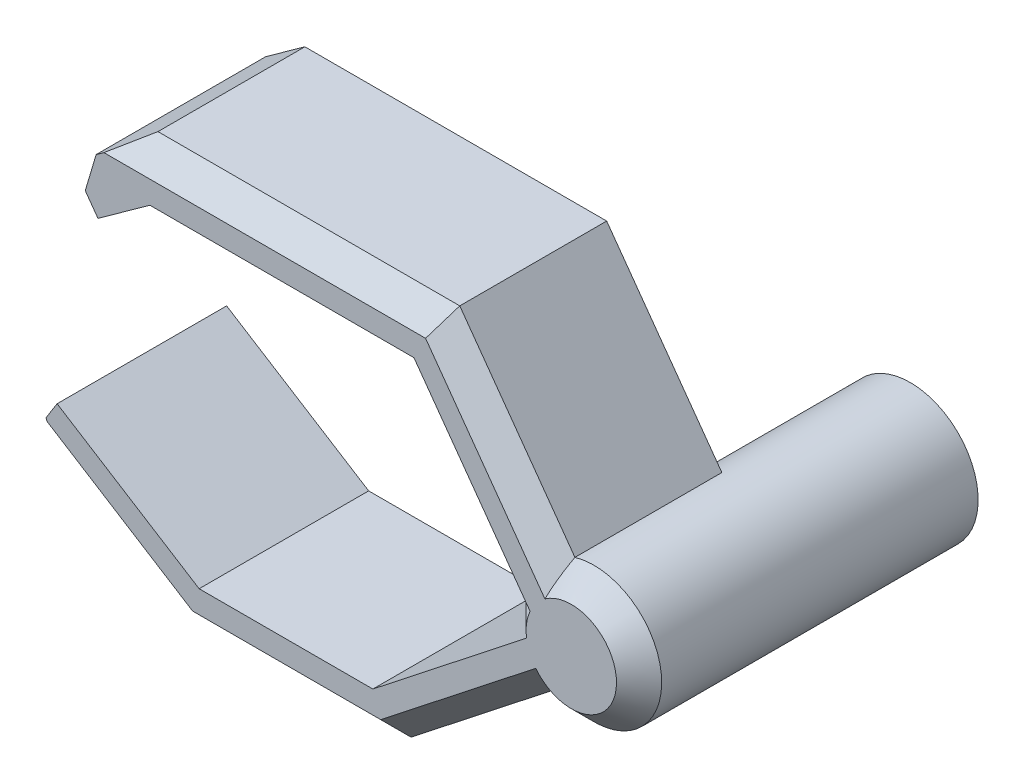
ISO-10303-21;
HEADER;
FILE_DESCRIPTION(('STEP AP214'),'2;1');
FILE_NAME('part.step','',(''),(''),'','','');
FILE_SCHEMA(('AUTOMOTIVE_DESIGN { 1 0 10303 214 1 1 1 1 }'));
ENDSEC;
DATA;
#1=APPLICATION_CONTEXT('core data for automotive mechanical design processes');
#2=APPLICATION_PROTOCOL_DEFINITION('international standard','automotive_design',2000,#1);
#3=PRODUCT_CONTEXT('',#1,'mechanical');
#4=PRODUCT('Part','Part','',(#3));
#5=PRODUCT_RELATED_PRODUCT_CATEGORY('part','',(#4));
#6=PRODUCT_DEFINITION_FORMATION('','',#4);
#7=PRODUCT_DEFINITION_CONTEXT('part definition',#1,'design');
#8=PRODUCT_DEFINITION('design','',#6,#7);
#9=PRODUCT_DEFINITION_SHAPE('','',#8);
#10=(LENGTH_UNIT() NAMED_UNIT(*) SI_UNIT(.MILLI.,.METRE.));
#11=(NAMED_UNIT(*) PLANE_ANGLE_UNIT() SI_UNIT($,.RADIAN.));
#12=(NAMED_UNIT(*) SI_UNIT($,.STERADIAN.) SOLID_ANGLE_UNIT());
#13=UNCERTAINTY_MEASURE_WITH_UNIT(LENGTH_MEASURE(1.E-05),#10,'distance_accuracy_value','');
#14=(GEOMETRIC_REPRESENTATION_CONTEXT(3) GLOBAL_UNCERTAINTY_ASSIGNED_CONTEXT((#13)) GLOBAL_UNIT_ASSIGNED_CONTEXT((#10,
#11,#12)) REPRESENTATION_CONTEXT('',''));
#15=CARTESIAN_POINT('',(0.,0.,0.));
#16=DIRECTION('',(0.,0.,1.));
#17=DIRECTION('',(1.,0.,0.));
#18=AXIS2_PLACEMENT_3D('',#15,#16,#17);
#19=CARTESIAN_POINT('',(0.,0.,0.));
#20=DIRECTION('',(0.,0.,1.));
#21=DIRECTION('',(1.,0.,0.));
#22=AXIS2_PLACEMENT_3D('',#19,#20,#21);
#23=PLANE('',#22);
#24=CARTESIAN_POINT('',(0.,0.,0.));
#25=DIRECTION('',(0.,0.,-1.));
#26=DIRECTION('',(-1.,0.,0.));
#27=AXIS2_PLACEMENT_3D('',#24,#25,#26);
#28=CIRCLE('',#27,6.);
#29=CARTESIAN_POINT('',(-4.92570755056817,3.4259896564753,0.));
#30=VERTEX_POINT('',#29);
#31=CARTESIAN_POINT('',(-1.67773652300311,5.76065969827948,0.));
#32=VERTEX_POINT('',#31);
#33=EDGE_CURVE('E54',#30,#32,#28,.T.);
#34=ORIENTED_EDGE('',*,*,#33,.F.);
#35=DIRECTION('',(0.583667510451045,-0.811992756891266,0.));
#36=VECTOR('',#35,1.);
#37=CARTESIAN_POINT('',(-2.74177615629843,0.387724819146812,0.));
#38=LINE('',#37,#36);
#39=CARTESIAN_POINT('',(-13.9203360042812,15.9392322553293,0.));
#40=VERTEX_POINT('',#39);
#41=EDGE_CURVE('E202',#40,#30,#38,.T.);
#42=ORIENTED_EDGE('',*,*,#41,.F.);
#43=DIRECTION('',(1.,0.,0.));
#44=VECTOR('',#43,1.);
#45=CARTESIAN_POINT('',(-13.9203360042812,15.9392322553293,0.));
#46=LINE('',#45,#44);
#47=CARTESIAN_POINT('',(-37.2880164769259,15.9392322553293,0.));
#48=VERTEX_POINT('',#47);
#49=EDGE_CURVE('E230',#48,#40,#46,.T.);
#50=ORIENTED_EDGE('',*,*,#49,.F.);
#51=DIRECTION('',(0.811992756891266,0.583667510451045,0.));
#52=VECTOR('',#51,1.);
#53=CARTESIAN_POINT('',(-37.2880164769259,15.9392322553293,0.));
#54=LINE('',#53,#52);
#55=CARTESIAN_POINT('',(-41.8852170549498,12.6347241871883,0.));
#56=VERTEX_POINT('',#55);
#57=EDGE_CURVE('E236',#56,#48,#54,.T.);
#58=ORIENTED_EDGE('',*,*,#57,.F.);
#59=DIRECTION('',(0.583667510451046,-0.811992756891266,0.));
#60=VECTOR('',#59,1.);
#61=CARTESIAN_POINT('',(-43.0096025455954,14.1989587179957,0.));
#62=LINE('',#61,#60);
#63=CARTESIAN_POINT('',(-43.0096025455954,14.1989587179957,0.));
#64=VERTEX_POINT('',#63);
#65=EDGE_CURVE('E510',#64,#56,#62,.T.);
#66=ORIENTED_EDGE('',*,*,#65,.F.);
#67=DIRECTION('',(-0.285038277399194,-0.958516134667174,0.));
#68=VECTOR('',#67,1.);
#69=CARTESIAN_POINT('',(-42.0437387137246,17.4469297455608,0.));
#70=LINE('',#69,#68);
#71=CARTESIAN_POINT('',(-42.0437387137246,17.4469297455608,0.));
#72=VERTEX_POINT('',#71);
#73=EDGE_CURVE('E506',#72,#64,#70,.T.);
#74=ORIENTED_EDGE('',*,*,#73,.F.);
#75=DIRECTION('',(-0.811992756891266,-0.583667510451045,0.));
#76=VECTOR('',#75,1.);
#77=CARTESIAN_POINT('',(-38.5764708777093,19.9392322553293,0.));
#78=LINE('',#77,#76);
#79=CARTESIAN_POINT('',(-38.5764708777093,19.9392322553293,0.));
#80=VERTEX_POINT('',#79);
#81=EDGE_CURVE('E502',#80,#72,#78,.T.);
#82=ORIENTED_EDGE('',*,*,#81,.F.);
#83=DIRECTION('',(-1.,0.,0.));
#84=VECTOR('',#83,1.);
#85=CARTESIAN_POINT('',(-11.8694187466304,19.9392322553293,0.));
#86=LINE('',#85,#84);
#87=CARTESIAN_POINT('',(-11.8694187466304,19.9392322553293,0.));
#88=VERTEX_POINT('',#87);
#89=EDGE_CURVE('E495',#88,#80,#86,.T.);
#90=ORIENTED_EDGE('',*,*,#89,.F.);
#91=DIRECTION('',(-0.583667510451046,0.811992756891266,0.));
#92=VECTOR('',#91,1.);
#93=CARTESIAN_POINT('',(2.74177615629843,-0.387724819146812,0.));
#94=LINE('',#93,#92);
#95=EDGE_CURVE('E205',#32,#88,#94,.T.);
#96=ORIENTED_EDGE('',*,*,#95,.F.);
#97=EDGE_LOOP('',(#34,#42,#50,#58,#66,#74,#82,#90,#96));
#98=FACE_BOUND('',#97,.T.);
#99=ADVANCED_FACE('F41',(#98),#23,.F.);
#100=CARTESIAN_POINT('',(-3.20927958866223,-5.06956847490948,0.));
#101=VERTEX_POINT('',#100);
#102=CARTESIAN_POINT('',(-5.68252967677999,-1.92583916060369,0.));
#103=VERTEX_POINT('',#102);
#104=EDGE_CURVE('E11',#101,#103,#28,.T.);
#105=ORIENTED_EDGE('',*,*,#104,.F.);
#106=DIRECTION('',(0.785932328576446,0.618312522029439,0.));
#107=VECTOR('',#106,1.);
#108=CARTESIAN_POINT('',(2.74177615629843,-0.387724819146812,0.));
#109=LINE('',#108,#107);
#110=CARTESIAN_POINT('',(-16.1754141997918,-15.2703492557461,0.));
#111=VERTEX_POINT('',#110);
#112=EDGE_CURVE('E484',#111,#101,#109,.T.);
#113=ORIENTED_EDGE('',*,*,#112,.F.);
#114=DIRECTION('',(1.,0.,0.));
#115=VECTOR('',#114,1.);
#116=CARTESIAN_POINT('',(-16.1754141997918,-15.2703492557461,0.));
#117=LINE('',#116,#115);
#118=CARTESIAN_POINT('',(-34.0839992741834,-15.2703492557461,0.));
#119=VERTEX_POINT('',#118);
#120=EDGE_CURVE('E301',#119,#111,#117,.T.);
#121=ORIENTED_EDGE('',*,*,#120,.F.);
#122=DIRECTION('',(0.846846656858256,-0.531837136507028,0.));
#123=VECTOR('',#122,1.);
#124=CARTESIAN_POINT('',(-34.0839992741834,-15.2703492557461,0.));
#125=LINE('',#124,#123);
#126=CARTESIAN_POINT('',(-45.1369510916235,-8.32886794158954,0.));
#127=VERTEX_POINT('',#126);
#128=EDGE_CURVE('E255',#127,#119,#125,.T.);
#129=ORIENTED_EDGE('',*,*,#128,.F.);
#130=DIRECTION('',(0.369338835561957,-0.929294799590387,0.));
#131=VECTOR('',#130,1.);
#132=CARTESIAN_POINT('',(-45.1369510916235,-8.32886794158954,0.));
#133=LINE('',#132,#131);
#134=CARTESIAN_POINT('',(-46.4832337062747,-4.94148131415651,0.));
#135=VERTEX_POINT('',#134);
#136=EDGE_CURVE('E251',#135,#127,#133,.T.);
#137=ORIENTED_EDGE('',*,*,#136,.F.);
#138=DIRECTION('',(-0.53183713650703,-0.846846656858255,0.));
#139=VECTOR('',#138,1.);
#140=CARTESIAN_POINT('',(-46.4832337062747,-4.94148131415651,0.));
#141=LINE('',#140,#139);
#142=CARTESIAN_POINT('',(-45.5007145627954,-3.37701167704294,0.));
#143=VERTEX_POINT('',#142);
#144=EDGE_CURVE('E247',#143,#135,#141,.T.);
#145=ORIENTED_EDGE('',*,*,#144,.F.);
#146=DIRECTION('',(-0.846846656858256,0.531837136507028,0.));
#147=VECTOR('',#146,1.);
#148=CARTESIAN_POINT('',(-32.9321177478378,-11.2703492557461,0.));
#149=LINE('',#148,#147);
#150=CARTESIAN_POINT('',(-32.9321177478378,-11.2703492557461,0.));
#151=VERTEX_POINT('',#150);
#152=EDGE_CURVE('E243',#151,#143,#149,.T.);
#153=ORIENTED_EDGE('',*,*,#152,.F.);
#154=DIRECTION('',(-1.,0.,0.));
#155=VECTOR('',#154,1.);
#156=CARTESIAN_POINT('',(-17.5602651532931,-11.2703492557461,0.));
#157=LINE('',#156,#155);
#158=CARTESIAN_POINT('',(-17.5602651532931,-11.2703492557461,0.));
#159=VERTEX_POINT('',#158);
#160=EDGE_CURVE('E234',#159,#151,#157,.T.);
#161=ORIENTED_EDGE('',*,*,#160,.F.);
#162=DIRECTION('',(-0.785932328576446,-0.618312522029439,0.));
#163=VECTOR('',#162,1.);
#164=CARTESIAN_POINT('',(-2.74177615629843,0.387724819146812,0.));
#165=LINE('',#164,#163);
#166=EDGE_CURVE('E229',#103,#159,#165,.T.);
#167=ORIENTED_EDGE('',*,*,#166,.F.);
#168=EDGE_LOOP('',(#105,#113,#121,#129,#137,#145,#153,#161,#167));
#169=FACE_BOUND('',#168,.T.);
#170=ADVANCED_FACE('F472',(#169),#23,.F.);
#171=CARTESIAN_POINT('',(0.,0.,15.));
#172=DIRECTION('',(0.,0.,-1.));
#173=DIRECTION('',(-1.,0.,0.));
#174=AXIS2_PLACEMENT_3D('',#171,#172,#173);
#175=CYLINDRICAL_SURFACE('',#174,6.);
#176=DIRECTION('',(0.,0.,-1.));
#177=VECTOR('',#176,1.);
#178=CARTESIAN_POINT('',(-1.6777365230031,5.76065969827948,15.));
#179=LINE('',#178,#177);
#180=CARTESIAN_POINT('',(-1.6777365230031,5.76065969827948,13.));
#181=VERTEX_POINT('',#180);
#182=EDGE_CURVE('E223',#32,#181,#179,.F.);
#183=ORIENTED_EDGE('',*,*,#182,.T.);
#184=CARTESIAN_POINT('',(0.,0.,13.));
#185=DIRECTION('',(0.,0.,1.));
#186=DIRECTION('',(1.,0.,0.));
#187=AXIS2_PLACEMENT_3D('',#184,#185,#186);
#188=CIRCLE('',#187,6.);
#189=CARTESIAN_POINT('',(-3.20927958866223,-5.06956847490948,13.));
#190=VERTEX_POINT('',#189);
#191=EDGE_CURVE('E392',#181,#190,#188,.F.);
#192=ORIENTED_EDGE('',*,*,#191,.T.);
#193=DIRECTION('',(0.,0.,-1.));
#194=VECTOR('',#193,1.);
#195=CARTESIAN_POINT('',(-3.20927958866223,-5.06956847490948,15.));
#196=LINE('',#195,#194);
#197=EDGE_CURVE('E306',#190,#101,#196,.T.);
#198=ORIENTED_EDGE('',*,*,#197,.T.);
#199=ORIENTED_EDGE('',*,*,#104,.T.);
#200=DIRECTION('',(0.,0.,-1.));
#201=VECTOR('',#200,1.);
#202=CARTESIAN_POINT('',(-5.68252967677999,-1.92583916060369,15.));
#203=LINE('',#202,#201);
#204=CARTESIAN_POINT('',(-5.68252967677999,-1.92583916060369,13.));
#205=VERTEX_POINT('',#204);
#206=EDGE_CURVE('E222',#103,#205,#203,.F.);
#207=ORIENTED_EDGE('',*,*,#206,.T.);
#208=CARTESIAN_POINT('',(0.,0.,13.));
#209=DIRECTION('',(0.,0.,1.));
#210=DIRECTION('',(1.,0.,0.));
#211=AXIS2_PLACEMENT_3D('',#208,#209,#210);
#212=CIRCLE('',#211,6.);
#213=CARTESIAN_POINT('',(-4.92570755056817,3.4259896564753,13.));
#214=VERTEX_POINT('',#213);
#215=EDGE_CURVE('E217',#205,#214,#212,.F.);
#216=ORIENTED_EDGE('',*,*,#215,.T.);
#217=DIRECTION('',(0.,0.,-1.));
#218=VECTOR('',#217,1.);
#219=CARTESIAN_POINT('',(-4.92570755056817,3.4259896564753,15.));
#220=LINE('',#219,#218);
#221=EDGE_CURVE('E212',#214,#30,#220,.T.);
#222=ORIENTED_EDGE('',*,*,#221,.T.);
#223=ORIENTED_EDGE('',*,*,#33,.T.);
#224=EDGE_LOOP('',(#183,#192,#198,#199,#207,#216,#222,#223));
#225=FACE_BOUND('',#224,.T.);
#226=CARTESIAN_POINT('',(0.,0.,-15.));
#227=DIRECTION('',(0.,0.,-1.));
#228=DIRECTION('',(-1.,0.,0.));
#229=AXIS2_PLACEMENT_3D('',#226,#227,#228);
#230=CIRCLE('',#229,6.);
#231=CARTESIAN_POINT('',(-6.,0.,-15.));
#232=VERTEX_POINT('',#231);
#233=EDGE_CURVE('E210',#232,#232,#230,.T.);
#234=ORIENTED_EDGE('',*,*,#233,.F.);
#235=EDGE_LOOP('',(#234));
#236=FACE_BOUND('',#235,.T.);
#237=ADVANCED_FACE('F213',(#225,#236),#175,.T.);
#238=CARTESIAN_POINT('',(0.,0.,15.));
#239=DIRECTION('',(0.,0.,1.));
#240=DIRECTION('',(1.,0.,0.));
#241=AXIS2_PLACEMENT_3D('',#238,#239,#240);
#242=PLANE('',#241);
#243=CARTESIAN_POINT('',(0.,0.,15.));
#244=DIRECTION('',(0.,0.,1.));
#245=DIRECTION('',(1.,0.,0.));
#246=AXIS2_PLACEMENT_3D('',#243,#244,#245);
#247=CIRCLE('',#246,4.);
#248=CARTESIAN_POINT('',(-3.64586907943943,1.6454903997251,15.));
#249=VERTEX_POINT('',#248);
#250=CARTESIAN_POINT('',(-3.95917449286952,-0.570032749069185,15.));
#251=VERTEX_POINT('',#250);
#252=EDGE_CURVE('E374',#249,#251,#247,.T.);
#253=ORIENTED_EDGE('',*,*,#252,.T.);
#254=DIRECTION('',(-0.785932328576446,-0.618312522029439,0.));
#255=VECTOR('',#254,1.);
#256=CARTESIAN_POINT('',(-2.74177615629843,0.387724819146812,15.));
#257=LINE('',#256,#255);
#258=CARTESIAN_POINT('',(-17.5602651532931,-11.2703492557461,15.));
#259=VERTEX_POINT('',#258);
#260=EDGE_CURVE('E282',#251,#259,#257,.T.);
#261=ORIENTED_EDGE('',*,*,#260,.T.);
#262=DIRECTION('',(-1.,0.,0.));
#263=VECTOR('',#262,1.);
#264=CARTESIAN_POINT('',(-17.5602651532931,-11.2703492557461,15.));
#265=LINE('',#264,#263);
#266=CARTESIAN_POINT('',(-32.9321177478378,-11.2703492557461,15.));
#267=VERTEX_POINT('',#266);
#268=EDGE_CURVE('E285',#259,#267,#265,.T.);
#269=ORIENTED_EDGE('',*,*,#268,.T.);
#270=DIRECTION('',(-0.846846656858256,0.531837136507028,0.));
#271=VECTOR('',#270,1.);
#272=CARTESIAN_POINT('',(-32.9321177478378,-11.2703492557461,15.));
#273=LINE('',#272,#271);
#274=CARTESIAN_POINT('',(-45.5007145627954,-3.37701167704294,15.));
#275=VERTEX_POINT('',#274);
#276=EDGE_CURVE('E289',#267,#275,#273,.T.);
#277=ORIENTED_EDGE('',*,*,#276,.T.);
#278=DIRECTION('',(-0.53183713650703,-0.846846656858255,0.));
#279=VECTOR('',#278,1.);
#280=CARTESIAN_POINT('',(-46.4832337062747,-4.94148131415651,15.));
#281=LINE('',#280,#279);
#282=CARTESIAN_POINT('',(-46.4832337062747,-4.94148131415651,15.));
#283=VERTEX_POINT('',#282);
#284=EDGE_CURVE('E293',#275,#283,#281,.T.);
#285=ORIENTED_EDGE('',*,*,#284,.T.);
#286=DIRECTION('',(0.369338835561957,-0.929294799590387,0.));
#287=VECTOR('',#286,1.);
#288=CARTESIAN_POINT('',(-45.1369510916235,-8.32886794158954,15.));
#289=LINE('',#288,#287);
#290=CARTESIAN_POINT('',(-46.3877978799942,-5.18160774689981,15.));
#291=VERTEX_POINT('',#290);
#292=EDGE_CURVE('E297',#283,#291,#289,.T.);
#293=ORIENTED_EDGE('',*,*,#292,.T.);
#294=DIRECTION('',(0.846846656858256,-0.531837136507028,0.));
#295=VECTOR('',#294,1.);
#296=CARTESIAN_POINT('',(-15.454538766258,-24.6083313652148,15.));
#297=LINE('',#296,#295);
#298=CARTESIAN_POINT('',(-33.5080585110106,-13.2703492557461,15.));
#299=VERTEX_POINT('',#298);
#300=EDGE_CURVE('E370',#291,#299,#297,.T.);
#301=ORIENTED_EDGE('',*,*,#300,.T.);
#302=DIRECTION('',(1.,0.,0.));
#303=VECTOR('',#302,1.);
#304=CARTESIAN_POINT('',(0.,-13.2703492557461,15.));
#305=LINE('',#304,#303);
#306=CARTESIAN_POINT('',(-16.8678396765425,-13.2703492557461,15.));
#307=VERTEX_POINT('',#306);
#308=EDGE_CURVE('E367',#299,#307,#305,.T.);
#309=ORIENTED_EDGE('',*,*,#308,.T.);
#310=DIRECTION('',(0.785932328576446,0.618312522029439,0.));
#311=VECTOR('',#310,1.);
#312=CARTESIAN_POINT('',(0.,0.,15.));
#313=LINE('',#312,#311);
#314=CARTESIAN_POINT('',(-3.14372931430579,-2.47325008811776,15.));
#315=VERTEX_POINT('',#314);
#316=EDGE_CURVE('E364',#307,#315,#313,.T.);
#317=ORIENTED_EDGE('',*,*,#316,.T.);
#318=CARTESIAN_POINT('',(0.,0.,15.));
#319=DIRECTION('',(0.,0.,1.));
#320=DIRECTION('',(1.,0.,0.));
#321=AXIS2_PLACEMENT_3D('',#318,#319,#320);
#322=CIRCLE('',#321,4.00000000000001);
#323=CARTESIAN_POINT('',(-2.33467004180419,3.24797102756507,15.));
#324=VERTEX_POINT('',#323);
#325=EDGE_CURVE('E361',#315,#324,#322,.T.);
#326=ORIENTED_EDGE('',*,*,#325,.T.);
#327=DIRECTION('',(-0.583667510451046,0.811992756891266,0.));
#328=VECTOR('',#327,1.);
#329=CARTESIAN_POINT('',(0.,0.,15.));
#330=LINE('',#329,#328);
#331=CARTESIAN_POINT('',(-12.8948773754558,17.9392322553294,15.));
#332=VERTEX_POINT('',#331);
#333=EDGE_CURVE('E358',#324,#332,#330,.T.);
#334=ORIENTED_EDGE('',*,*,#333,.T.);
#335=DIRECTION('',(-1.,0.,0.));
#336=VECTOR('',#335,1.);
#337=CARTESIAN_POINT('',(0.,17.9392322553294,15.));
#338=LINE('',#337,#336);
#339=CARTESIAN_POINT('',(-41.3588520873942,17.9392322553294,15.));
#340=VERTEX_POINT('',#339);
#341=EDGE_CURVE('E355',#332,#340,#338,.T.);
#342=ORIENTED_EDGE('',*,*,#341,.T.);
#343=DIRECTION('',(-0.811992756891266,-0.583667510451045,0.));
#344=VECTOR('',#343,1.);
#345=CARTESIAN_POINT('',(-38.5764708777093,19.9392322553293,15.));
#346=LINE('',#345,#344);
#347=CARTESIAN_POINT('',(-42.0437387137246,17.4469297455608,15.));
#348=VERTEX_POINT('',#347);
#349=EDGE_CURVE('E260',#340,#348,#346,.T.);
#350=ORIENTED_EDGE('',*,*,#349,.T.);
#351=DIRECTION('',(-0.285038277399194,-0.958516134667174,0.));
#352=VECTOR('',#351,1.);
#353=CARTESIAN_POINT('',(-42.0437387137246,17.4469297455608,15.));
#354=LINE('',#353,#352);
#355=CARTESIAN_POINT('',(-43.0096025455954,14.1989587179957,15.));
#356=VERTEX_POINT('',#355);
#357=EDGE_CURVE('E263',#348,#356,#354,.T.);
#358=ORIENTED_EDGE('',*,*,#357,.T.);
#359=DIRECTION('',(0.583667510451046,-0.811992756891266,0.));
#360=VECTOR('',#359,1.);
#361=CARTESIAN_POINT('',(-43.0096025455954,14.1989587179957,15.));
#362=LINE('',#361,#360);
#363=CARTESIAN_POINT('',(-41.8852170549498,12.6347241871883,15.));
#364=VERTEX_POINT('',#363);
#365=EDGE_CURVE('E267',#356,#364,#362,.T.);
#366=ORIENTED_EDGE('',*,*,#365,.T.);
#367=DIRECTION('',(0.811992756891266,0.583667510451045,0.));
#368=VECTOR('',#367,1.);
#369=CARTESIAN_POINT('',(-37.2880164769259,15.9392322553293,15.));
#370=LINE('',#369,#368);
#371=CARTESIAN_POINT('',(-37.2880164769259,15.9392322553293,15.));
#372=VERTEX_POINT('',#371);
#373=EDGE_CURVE('E271',#364,#372,#370,.T.);
#374=ORIENTED_EDGE('',*,*,#373,.T.);
#375=DIRECTION('',(1.,0.,0.));
#376=VECTOR('',#375,1.);
#377=CARTESIAN_POINT('',(-13.9203360042812,15.9392322553293,15.));
#378=LINE('',#377,#376);
#379=CARTESIAN_POINT('',(-13.9203360042812,15.9392322553293,15.));
#380=VERTEX_POINT('',#379);
#381=EDGE_CURVE('E275',#372,#380,#378,.T.);
#382=ORIENTED_EDGE('',*,*,#381,.T.);
#383=DIRECTION('',(0.583667510451045,-0.811992756891266,0.));
#384=VECTOR('',#383,1.);
#385=CARTESIAN_POINT('',(-2.74177615629843,0.387724819146812,15.));
#386=LINE('',#385,#384);
#387=EDGE_CURVE('E279',#380,#249,#386,.T.);
#388=ORIENTED_EDGE('',*,*,#387,.T.);
#389=EDGE_LOOP('',(#253,#261,#269,#277,#285,#293,#301,#309,#317,#326,#334,#342,#350,#358,#366,
#374,#382,#388));
#390=FACE_BOUND('',#389,.T.);
#391=ADVANCED_FACE('F466',(#390),#242,.T.);
#392=CARTESIAN_POINT('',(-16.1754141997918,-15.2703492557461,0.));
#393=DIRECTION('',(0.,-1.,0.));
#394=DIRECTION('',(1.,0.,0.));
#395=AXIS2_PLACEMENT_3D('',#392,#393,#394);
#396=PLANE('',#395);
#397=DIRECTION('',(0.,0.,1.));
#398=VECTOR('',#397,1.);
#399=CARTESIAN_POINT('',(-16.1754141997918,-15.2703492557461,0.));
#400=LINE('',#399,#398);
#401=CARTESIAN_POINT('',(-16.1754141997918,-15.2703492557461,13.));
#402=VERTEX_POINT('',#401);
#403=EDGE_CURVE('E259',#111,#402,#400,.T.);
#404=ORIENTED_EDGE('',*,*,#403,.T.);
#405=DIRECTION('',(-1.,0.,0.));
#406=VECTOR('',#405,1.);
#407=CARTESIAN_POINT('',(-16.1754141997918,-15.2703492557461,13.));
#408=LINE('',#407,#406);
#409=CARTESIAN_POINT('',(-34.0839992741834,-15.2703492557461,13.));
#410=VERTEX_POINT('',#409);
#411=EDGE_CURVE('E386',#402,#410,#408,.T.);
#412=ORIENTED_EDGE('',*,*,#411,.T.);
#413=DIRECTION('',(0.,0.,1.));
#414=VECTOR('',#413,1.);
#415=CARTESIAN_POINT('',(-34.0839992741834,-15.2703492557461,0.));
#416=LINE('',#415,#414);
#417=EDGE_CURVE('E302',#119,#410,#416,.T.);
#418=ORIENTED_EDGE('',*,*,#417,.F.);
#419=ORIENTED_EDGE('',*,*,#120,.T.);
#420=EDGE_LOOP('',(#404,#412,#418,#419));
#421=FACE_BOUND('',#420,.T.);
#422=ADVANCED_FACE('F462',(#421),#396,.T.);
#423=CARTESIAN_POINT('',(-34.0839992741834,-15.2703492557461,0.));
#424=DIRECTION('',(-0.531837136507028,-0.846846656858256,0.));
#425=DIRECTION('',(0.846846656858256,-0.531837136507028,0.));
#426=AXIS2_PLACEMENT_3D('',#423,#424,#425);
#427=PLANE('',#426);
#428=ORIENTED_EDGE('',*,*,#417,.T.);
#429=DIRECTION('',(-0.846846656858256,0.531837136507028,0.));
#430=VECTOR('',#429,1.);
#431=CARTESIAN_POINT('',(-34.0839992741834,-15.2703492557461,13.));
#432=LINE('',#431,#430);
#433=CARTESIAN_POINT('',(-45.1369510916235,-8.32886794158954,13.));
#434=VERTEX_POINT('',#433);
#435=EDGE_CURVE('E380',#410,#434,#432,.T.);
#436=ORIENTED_EDGE('',*,*,#435,.T.);
#437=DIRECTION('',(0.,0.,1.));
#438=VECTOR('',#437,1.);
#439=CARTESIAN_POINT('',(-45.1369510916235,-8.32886794158954,0.));
#440=LINE('',#439,#438);
#441=EDGE_CURVE('E307',#127,#434,#440,.T.);
#442=ORIENTED_EDGE('',*,*,#441,.F.);
#443=ORIENTED_EDGE('',*,*,#128,.T.);
#444=EDGE_LOOP('',(#428,#436,#442,#443));
#445=FACE_BOUND('',#444,.T.);
#446=ADVANCED_FACE('F465',(#445),#427,.T.);
#447=CARTESIAN_POINT('',(-45.1369510916235,-8.32886794158954,0.));
#448=DIRECTION('',(-0.929294799590387,-0.369338835561957,0.));
#449=DIRECTION('',(0.369338835561957,-0.929294799590387,0.));
#450=AXIS2_PLACEMENT_3D('',#447,#448,#449);
#451=PLANE('',#450);
#452=ORIENTED_EDGE('',*,*,#441,.T.);
#453=DIRECTION('',(0.318024709109134,-0.800183137705233,-0.508495064408947));
#454=VECTOR('',#453,1.);
#455=CARTESIAN_POINT('',(-43.0346691573764,-13.6184272314924,9.63862600313263));
#456=LINE('',#455,#454);
#457=EDGE_CURVE('E383',#434,#291,#456,.F.);
#458=ORIENTED_EDGE('',*,*,#457,.T.);
#459=ORIENTED_EDGE('',*,*,#292,.F.);
#460=DIRECTION('',(0.,0.,1.));
#461=VECTOR('',#460,1.);
#462=CARTESIAN_POINT('',(-46.4832337062747,-4.94148131415651,0.));
#463=LINE('',#462,#461);
#464=EDGE_CURVE('E311',#135,#283,#463,.T.);
#465=ORIENTED_EDGE('',*,*,#464,.F.);
#466=ORIENTED_EDGE('',*,*,#136,.T.);
#467=EDGE_LOOP('',(#452,#458,#459,#465,#466));
#468=FACE_BOUND('',#467,.T.);
#469=ADVANCED_FACE('F557',(#468),#451,.T.);
#470=CARTESIAN_POINT('',(-46.4832337062747,-4.94148131415651,0.));
#471=DIRECTION('',(-0.846846656858255,0.53183713650703,0.));
#472=DIRECTION('',(-0.53183713650703,-0.846846656858255,0.));
#473=AXIS2_PLACEMENT_3D('',#470,#471,#472);
#474=PLANE('',#473);
#475=ORIENTED_EDGE('',*,*,#284,.F.);
#476=DIRECTION('',(0.,0.,1.));
#477=VECTOR('',#476,1.);
#478=CARTESIAN_POINT('',(-45.5007145627954,-3.37701167704294,0.));
#479=LINE('',#478,#477);
#480=EDGE_CURVE('E314',#143,#275,#479,.T.);
#481=ORIENTED_EDGE('',*,*,#480,.F.);
#482=ORIENTED_EDGE('',*,*,#144,.T.);
#483=ORIENTED_EDGE('',*,*,#464,.T.);
#484=EDGE_LOOP('',(#475,#481,#482,#483));
#485=FACE_BOUND('',#484,.T.);
#486=ADVANCED_FACE('F563',(#485),#474,.T.);
#487=CARTESIAN_POINT('',(-32.9321177478378,-11.2703492557461,0.));
#488=DIRECTION('',(0.531837136507028,0.846846656858256,0.));
#489=DIRECTION('',(-0.846846656858256,0.531837136507028,0.));
#490=AXIS2_PLACEMENT_3D('',#487,#488,#489);
#491=PLANE('',#490);
#492=ORIENTED_EDGE('',*,*,#276,.F.);
#493=DIRECTION('',(0.,0.,1.));
#494=VECTOR('',#493,1.);
#495=CARTESIAN_POINT('',(-32.9321177478378,-11.2703492557461,0.));
#496=LINE('',#495,#494);
#497=EDGE_CURVE('E317',#151,#267,#496,.T.);
#498=ORIENTED_EDGE('',*,*,#497,.F.);
#499=ORIENTED_EDGE('',*,*,#152,.T.);
#500=ORIENTED_EDGE('',*,*,#480,.T.);
#501=EDGE_LOOP('',(#492,#498,#499,#500));
#502=FACE_BOUND('',#501,.T.);
#503=ADVANCED_FACE('F566',(#502),#491,.T.);
#504=CARTESIAN_POINT('',(-17.5602651532931,-11.2703492557461,0.));
#505=DIRECTION('',(0.,1.,0.));
#506=DIRECTION('',(0.,0.,1.));
#507=AXIS2_PLACEMENT_3D('',#504,#505,#506);
#508=PLANE('',#507);
#509=ORIENTED_EDGE('',*,*,#268,.F.);
#510=DIRECTION('',(0.,0.,1.));
#511=VECTOR('',#510,1.);
#512=CARTESIAN_POINT('',(-17.5602651532931,-11.2703492557461,0.));
#513=LINE('',#512,#511);
#514=EDGE_CURVE('E320',#159,#259,#513,.T.);
#515=ORIENTED_EDGE('',*,*,#514,.F.);
#516=ORIENTED_EDGE('',*,*,#160,.T.);
#517=ORIENTED_EDGE('',*,*,#497,.T.);
#518=EDGE_LOOP('',(#509,#515,#516,#517));
#519=FACE_BOUND('',#518,.T.);
#520=ADVANCED_FACE('F428',(#519),#508,.T.);
#521=CARTESIAN_POINT('',(2.74177615629843,-0.387724819146812,0.));
#522=DIRECTION('',(0.618312522029439,-0.785932328576446,0.));
#523=DIRECTION('',(0.785932328576446,0.618312522029439,0.));
#524=AXIS2_PLACEMENT_3D('',#521,#522,#523);
#525=PLANE('',#524);
#526=ORIENTED_EDGE('',*,*,#197,.F.);
#527=DIRECTION('',(-0.785932328576446,-0.618312522029439,0.));
#528=VECTOR('',#527,1.);
#529=CARTESIAN_POINT('',(2.74177615629843,-0.387724819146812,13.));
#530=LINE('',#529,#528);
#531=EDGE_CURVE('E389',#190,#402,#530,.T.);
#532=ORIENTED_EDGE('',*,*,#531,.T.);
#533=ORIENTED_EDGE('',*,*,#403,.F.);
#534=ORIENTED_EDGE('',*,*,#112,.T.);
#535=EDGE_LOOP('',(#526,#532,#533,#534));
#536=FACE_BOUND('',#535,.T.);
#537=ADVANCED_FACE('F426',(#536),#525,.T.);
#538=CARTESIAN_POINT('',(-2.74177615629843,0.387724819146812,0.));
#539=DIRECTION('',(-0.618312522029439,0.785932328576446,0.));
#540=DIRECTION('',(-0.785932328576446,-0.618312522029439,0.));
#541=AXIS2_PLACEMENT_3D('',#538,#539,#540);
#542=PLANE('',#541);
#543=ORIENTED_EDGE('',*,*,#206,.F.);
#544=ORIENTED_EDGE('',*,*,#166,.T.);
#545=ORIENTED_EDGE('',*,*,#514,.T.);
#546=ORIENTED_EDGE('',*,*,#260,.F.);
#547=CARTESIAN_POINT('',(-3.95917449286952,-0.570032749069185,15.));
#548=CARTESIAN_POINT('',(-4.0326512346754,-0.627838730429933,14.9190245665213));
#549=CARTESIAN_POINT('',(-4.10581686855001,-0.685399955438751,14.8375950870917));
#550=CARTESIAN_POINT('',(-4.25161800243795,-0.800105335954522,14.6739749288848));
#551=CARTESIAN_POINT('',(-4.32425351368668,-0.857249500300636,14.5917842663242));
#552=CARTESIAN_POINT('',(-4.54149286261855,-1.02815710244164,14.3443024744829));
#553=CARTESIAN_POINT('',(-4.68544447353481,-1.14140741720736,14.1780849550509));
#554=CARTESIAN_POINT('',(-4.97210015790169,-1.36692657796767,13.8439439214904));
#555=CARTESIAN_POINT('',(-5.11480430204817,-1.47919547958046,13.6760205052192));
#556=CARTESIAN_POINT('',(-5.39928858443149,-1.70300634436163,13.3388733185191));
#557=CARTESIAN_POINT('',(-5.54106862667801,-1.81454823201202,13.1696494168597));
#558=CARTESIAN_POINT('',(-5.68252967677999,-1.92583916060369,13.));
#559=B_SPLINE_CURVE_WITH_KNOTS('',3,(#547,#548,#549,#550,#551,#552,#553,#554,#555,#556,#557,
#558),.UNSPECIFIED.,.F.,.F.,(4,2,2,2,2,4),(0.,0.371043399232291,0.742078911620059,
1.48407420808337,2.22602717831648,2.96805602782539),.UNSPECIFIED.);
#560=EDGE_CURVE('E402',#251,#205,#559,.T.);
#561=ORIENTED_EDGE('',*,*,#560,.T.);
#562=EDGE_LOOP('',(#543,#544,#545,#546,#561));
#563=FACE_BOUND('',#562,.T.);
#564=ADVANCED_FACE('F422',(#563),#542,.T.);
#565=CARTESIAN_POINT('',(-2.74177615629843,0.387724819146812,0.));
#566=DIRECTION('',(-0.811992756891266,-0.583667510451045,0.));
#567=DIRECTION('',(0.583667510451045,-0.811992756891266,0.));
#568=AXIS2_PLACEMENT_3D('',#565,#566,#567);
#569=PLANE('',#568);
#570=ORIENTED_EDGE('',*,*,#221,.F.);
#571=CARTESIAN_POINT('',(-4.92570755056817,3.4259896564753,13.));
#572=CARTESIAN_POINT('',(-4.82065242567165,3.27983795372872,13.1696494168597));
#573=CARTESIAN_POINT('',(-4.7153604033425,3.13335668149954,13.3388733185191));
#574=CARTESIAN_POINT('',(-4.50409000915744,2.83943929402793,13.6760205052192));
#575=CARTESIAN_POINT('',(-4.39811170858812,2.69200327795873,13.8439439214904));
#576=CARTESIAN_POINT('',(-4.18522873690262,2.39584248781892,14.1780849550509));
#577=CARTESIAN_POINT('',(-4.07832401328463,2.24711764070829,14.3443024744829));
#578=CARTESIAN_POINT('',(-3.91699262971279,2.02267493561693,14.5917842663242));
#579=CARTESIAN_POINT('',(-3.86305034170732,1.94763093134001,14.6739749288848));
#580=CARTESIAN_POINT('',(-3.75477208193468,1.79699523363562,14.8375950870917));
#581=CARTESIAN_POINT('',(-3.70043610182362,1.72140352860022,14.9190245665213));
#582=CARTESIAN_POINT('',(-3.64586907943943,1.6454903997251,15.));
#583=B_SPLINE_CURVE_WITH_KNOTS('',3,(#571,#572,#573,#574,#575,#576,#577,#578,#579,#580,#581,
#582),.UNSPECIFIED.,.F.,.F.,(4,2,2,2,2,4),(0.,0.742028849508901,1.48398181974201,
2.22597711620533,2.5970126285931,2.96805602782539),.UNSPECIFIED.);
#584=EDGE_CURVE('E52',#214,#249,#583,.T.);
#585=ORIENTED_EDGE('',*,*,#584,.T.);
#586=ORIENTED_EDGE('',*,*,#387,.F.);
#587=DIRECTION('',(0.,0.,1.));
#588=VECTOR('',#587,1.);
#589=CARTESIAN_POINT('',(-13.9203360042812,15.9392322553293,0.));
#590=LINE('',#589,#588);
#591=EDGE_CURVE('E227',#40,#380,#590,.T.);
#592=ORIENTED_EDGE('',*,*,#591,.F.);
#593=ORIENTED_EDGE('',*,*,#41,.T.);
#594=EDGE_LOOP('',(#570,#585,#586,#592,#593));
#595=FACE_BOUND('',#594,.T.);
#596=ADVANCED_FACE('F225',(#595),#569,.T.);
#597=CARTESIAN_POINT('',(2.74177615629843,-0.387724819146812,0.));
#598=DIRECTION('',(0.811992756891266,0.583667510451046,0.));
#599=DIRECTION('',(-0.583667510451046,0.811992756891266,0.));
#600=AXIS2_PLACEMENT_3D('',#597,#598,#599);
#601=PLANE('',#600);
#602=DIRECTION('',(0.,0.,1.));
#603=VECTOR('',#602,1.);
#604=CARTESIAN_POINT('',(-11.8694187466304,19.9392322553293,0.));
#605=LINE('',#604,#603);
#606=CARTESIAN_POINT('',(-11.8694187466304,19.9392322553293,13.));
#607=VERTEX_POINT('',#606);
#608=EDGE_CURVE('E342',#88,#607,#605,.T.);
#609=ORIENTED_EDGE('',*,*,#608,.T.);
#610=DIRECTION('',(0.583667510451046,-0.811992756891266,0.));
#611=VECTOR('',#610,1.);
#612=CARTESIAN_POINT('',(2.74177615629843,-0.387724819146812,13.));
#613=LINE('',#612,#611);
#614=EDGE_CURVE('E395',#607,#181,#613,.T.);
#615=ORIENTED_EDGE('',*,*,#614,.T.);
#616=ORIENTED_EDGE('',*,*,#182,.F.);
#617=ORIENTED_EDGE('',*,*,#95,.T.);
#618=EDGE_LOOP('',(#609,#615,#616,#617));
#619=FACE_BOUND('',#618,.T.);
#620=ADVANCED_FACE('F433',(#619),#601,.T.);
#621=CARTESIAN_POINT('',(-13.9203360042812,15.9392322553293,0.));
#622=DIRECTION('',(0.,-1.,0.));
#623=DIRECTION('',(0.,0.,-1.));
#624=AXIS2_PLACEMENT_3D('',#621,#622,#623);
#625=PLANE('',#624);
#626=ORIENTED_EDGE('',*,*,#381,.F.);
#627=DIRECTION('',(0.,0.,1.));
#628=VECTOR('',#627,1.);
#629=CARTESIAN_POINT('',(-37.2880164769259,15.9392322553293,0.));
#630=LINE('',#629,#628);
#631=EDGE_CURVE('E326',#48,#372,#630,.T.);
#632=ORIENTED_EDGE('',*,*,#631,.F.);
#633=ORIENTED_EDGE('',*,*,#49,.T.);
#634=ORIENTED_EDGE('',*,*,#591,.T.);
#635=EDGE_LOOP('',(#626,#632,#633,#634));
#636=FACE_BOUND('',#635,.T.);
#637=ADVANCED_FACE('F434',(#636),#625,.T.);
#638=CARTESIAN_POINT('',(-37.2880164769259,15.9392322553293,0.));
#639=DIRECTION('',(0.583667510451045,-0.811992756891266,0.));
#640=DIRECTION('',(0.811992756891266,0.583667510451045,0.));
#641=AXIS2_PLACEMENT_3D('',#638,#639,#640);
#642=PLANE('',#641);
#643=ORIENTED_EDGE('',*,*,#373,.F.);
#644=DIRECTION('',(0.,0.,1.));
#645=VECTOR('',#644,1.);
#646=CARTESIAN_POINT('',(-41.8852170549498,12.6347241871883,0.));
#647=LINE('',#646,#645);
#648=EDGE_CURVE('E329',#56,#364,#647,.T.);
#649=ORIENTED_EDGE('',*,*,#648,.F.);
#650=ORIENTED_EDGE('',*,*,#57,.T.);
#651=ORIENTED_EDGE('',*,*,#631,.T.);
#652=EDGE_LOOP('',(#643,#649,#650,#651));
#653=FACE_BOUND('',#652,.T.);
#654=ADVANCED_FACE('F437',(#653),#642,.T.);
#655=CARTESIAN_POINT('',(-43.0096025455954,14.1989587179957,0.));
#656=DIRECTION('',(-0.811992756891266,-0.583667510451046,0.));
#657=DIRECTION('',(0.583667510451046,-0.811992756891266,0.));
#658=AXIS2_PLACEMENT_3D('',#655,#656,#657);
#659=PLANE('',#658);
#660=ORIENTED_EDGE('',*,*,#365,.F.);
#661=DIRECTION('',(0.,0.,1.));
#662=VECTOR('',#661,1.);
#663=CARTESIAN_POINT('',(-43.0096025455954,14.1989587179957,0.));
#664=LINE('',#663,#662);
#665=EDGE_CURVE('E332',#64,#356,#664,.T.);
#666=ORIENTED_EDGE('',*,*,#665,.F.);
#667=ORIENTED_EDGE('',*,*,#65,.T.);
#668=ORIENTED_EDGE('',*,*,#648,.T.);
#669=EDGE_LOOP('',(#660,#666,#667,#668));
#670=FACE_BOUND('',#669,.T.);
#671=ADVANCED_FACE('F441',(#670),#659,.T.);
#672=CARTESIAN_POINT('',(-42.0437387137246,17.4469297455608,0.));
#673=DIRECTION('',(-0.958516134667174,0.285038277399194,0.));
#674=DIRECTION('',(-0.285038277399194,-0.958516134667174,0.));
#675=AXIS2_PLACEMENT_3D('',#672,#673,#674);
#676=PLANE('',#675);
#677=ORIENTED_EDGE('',*,*,#357,.F.);
#678=DIRECTION('',(0.,0.,1.));
#679=VECTOR('',#678,1.);
#680=CARTESIAN_POINT('',(-42.0437387137246,17.4469297455608,0.));
#681=LINE('',#680,#679);
#682=EDGE_CURVE('E335',#72,#348,#681,.T.);
#683=ORIENTED_EDGE('',*,*,#682,.F.);
#684=ORIENTED_EDGE('',*,*,#73,.T.);
#685=ORIENTED_EDGE('',*,*,#665,.T.);
#686=EDGE_LOOP('',(#677,#683,#684,#685));
#687=FACE_BOUND('',#686,.T.);
#688=ADVANCED_FACE('F445',(#687),#676,.T.);
#689=CARTESIAN_POINT('',(-38.5764708777093,19.9392322553293,0.));
#690=DIRECTION('',(-0.583667510451045,0.811992756891266,0.));
#691=DIRECTION('',(-0.811992756891266,-0.583667510451045,0.));
#692=AXIS2_PLACEMENT_3D('',#689,#690,#691);
#693=PLANE('',#692);
#694=ORIENTED_EDGE('',*,*,#349,.F.);
#695=DIRECTION('',(-0.701280191618131,-0.504086348180564,0.504086348180567));
#696=VECTOR('',#695,1.);
#697=CARTESIAN_POINT('',(-33.9808958567353,23.2425718588156,9.69666039651374));
#698=LINE('',#697,#696);
#699=CARTESIAN_POINT('',(-38.5764708777093,19.9392322553293,13.));
#700=VERTEX_POINT('',#699);
#701=EDGE_CURVE('E61',#340,#700,#698,.F.);
#702=ORIENTED_EDGE('',*,*,#701,.T.);
#703=DIRECTION('',(0.,0.,1.));
#704=VECTOR('',#703,1.);
#705=CARTESIAN_POINT('',(-38.5764708777093,19.9392322553293,0.));
#706=LINE('',#705,#704);
#707=EDGE_CURVE('E339',#80,#700,#706,.T.);
#708=ORIENTED_EDGE('',*,*,#707,.F.);
#709=ORIENTED_EDGE('',*,*,#81,.T.);
#710=ORIENTED_EDGE('',*,*,#682,.T.);
#711=EDGE_LOOP('',(#694,#702,#708,#709,#710));
#712=FACE_BOUND('',#711,.T.);
#713=ADVANCED_FACE('F449',(#712),#693,.T.);
#714=CARTESIAN_POINT('',(-11.8694187466304,19.9392322553293,0.));
#715=DIRECTION('',(0.,1.,0.));
#716=DIRECTION('',(0.,0.,1.));
#717=AXIS2_PLACEMENT_3D('',#714,#715,#716);
#718=PLANE('',#717);
#719=ORIENTED_EDGE('',*,*,#707,.T.);
#720=DIRECTION('',(1.,0.,0.));
#721=VECTOR('',#720,1.);
#722=CARTESIAN_POINT('',(-11.8694187466304,19.9392322553293,13.));
#723=LINE('',#722,#721);
#724=EDGE_CURVE('E68',#700,#607,#723,.T.);
#725=ORIENTED_EDGE('',*,*,#724,.T.);
#726=ORIENTED_EDGE('',*,*,#608,.F.);
#727=ORIENTED_EDGE('',*,*,#89,.T.);
#728=EDGE_LOOP('',(#719,#725,#726,#727));
#729=FACE_BOUND('',#728,.T.);
#730=ADVANCED_FACE('F453',(#729),#718,.T.);
#731=CARTESIAN_POINT('',(0.,0.,15.));
#732=DIRECTION('',(0.,0.,-1.));
#733=DIRECTION('',(-1.,0.,0.));
#734=AXIS2_PLACEMENT_3D('',#731,#732,#733);
#735=CONICAL_SURFACE('',#734,4.,0.785398163397446);
#736=ORIENTED_EDGE('',*,*,#584,.F.);
#737=ORIENTED_EDGE('',*,*,#215,.F.);
#738=ORIENTED_EDGE('',*,*,#560,.F.);
#739=ORIENTED_EDGE('',*,*,#252,.F.);
#740=EDGE_LOOP('',(#736,#737,#738,#739));
#741=FACE_BOUND('',#740,.T.);
#742=ADVANCED_FACE('F418',(#741),#735,.T.);
#743=CARTESIAN_POINT('',(0.,17.9392322553294,15.));
#744=DIRECTION('',(0.,-0.70710678118655,-0.707106781186545));
#745=DIRECTION('',(-1.,0.,0.));
#746=AXIS2_PLACEMENT_3D('',#743,#744,#745);
#747=PLANE('',#746);
#748=ORIENTED_EDGE('',*,*,#701,.F.);
#749=ORIENTED_EDGE('',*,*,#341,.F.);
#750=DIRECTION('',(0.340844505172188,0.664765004830248,-0.664765004830253));
#751=VECTOR('',#750,1.);
#752=CARTESIAN_POINT('',(-11.3968152967346,20.8609729021209,12.0782593532084));
#753=LINE('',#752,#751);
#754=EDGE_CURVE('E46',#607,#332,#753,.F.);
#755=ORIENTED_EDGE('',*,*,#754,.F.);
#756=ORIENTED_EDGE('',*,*,#724,.F.);
#757=EDGE_LOOP('',(#748,#749,#755,#756));
#758=FACE_BOUND('',#757,.T.);
#759=ADVANCED_FACE('F44',(#758),#747,.F.);
#760=CARTESIAN_POINT('',(0.,0.,15.));
#761=DIRECTION('',(-0.574165584672174,-0.412715254598205,-0.707106781186547));
#762=DIRECTION('',(-0.583667510451046,0.811992756891266,0.));
#763=AXIS2_PLACEMENT_3D('',#760,#761,#762);
#764=PLANE('',#763);
#765=ORIENTED_EDGE('',*,*,#754,.T.);
#766=ORIENTED_EDGE('',*,*,#333,.F.);
#767=CARTESIAN_POINT('',(-2.33467004180419,3.24797102756507,15.));
#768=CARTESIAN_POINT('',(-2.31661865683118,3.35826045077335,14.920970053077));
#769=CARTESIAN_POINT('',(-2.29704029506545,3.46773565261627,14.8411754466157));
#770=CARTESIAN_POINT('',(-2.25514079132295,3.68515105197979,14.6802550481792));
#771=CARTESIAN_POINT('',(-2.23282001709275,3.7930914531499,14.599129435948));
#772=CARTESIAN_POINT('',(-2.16226913805766,4.11449225127502,14.3542514294805));
#773=CARTESIAN_POINT('',(-2.11039784889169,4.32584248788909,14.1887740519494));
#774=CARTESIAN_POINT('',(-1.99882235496271,4.74344944427383,13.8544319464524));
#775=CARTESIAN_POINT('',(-1.93912360642125,4.94970959423346,13.685569646809));
#776=CARTESIAN_POINT('',(-1.84464056571773,5.25598797994606,13.4300853592149));
#777=CARTESIAN_POINT('',(-1.81229873291774,5.35763400082487,13.3444965452831));
#778=CARTESIAN_POINT('',(-1.74611235574777,5.55989908622402,13.1726981275701));
#779=CARTESIAN_POINT('',(-1.71226788013399,5.66051819747395,13.0864885523439));
#780=CARTESIAN_POINT('',(-1.67773652300311,5.76065969827948,13.));
#781=B_SPLINE_CURVE_WITH_KNOTS('',3,(#767,#768,#769,#770,#771,#772,#773,#774,#775,#776,#777,
#778,#779,#780),.UNSPECIFIED.,.F.,.F.,(4,2,2,2,2,2,4),(0.,0.410597546893931,0.821140094262644,
1.6410678856171,2.46042714547638,2.87069637972711,3.28094686065791),.UNSPECIFIED.);
#782=EDGE_CURVE('E531',#181,#324,#781,.F.);
#783=ORIENTED_EDGE('',*,*,#782,.F.);
#784=ORIENTED_EDGE('',*,*,#614,.F.);
#785=EDGE_LOOP('',(#765,#766,#783,#784));
#786=FACE_BOUND('',#785,.T.);
#787=ADVANCED_FACE('F533',(#786),#764,.F.);
#788=CARTESIAN_POINT('',(0.,0.,15.));
#789=DIRECTION('',(0.,0.,-1.));
#790=DIRECTION('',(-1.,0.,0.));
#791=AXIS2_PLACEMENT_3D('',#788,#789,#790);
#792=CONICAL_SURFACE('',#791,4.00000000000001,0.785398163397445);
#793=ORIENTED_EDGE('',*,*,#782,.T.);
#794=ORIENTED_EDGE('',*,*,#325,.F.);
#795=CARTESIAN_POINT('',(-3.14372931430579,-2.47325008811776,15.));
#796=CARTESIAN_POINT('',(-3.15696707105475,-2.58422022449379,14.920970053077));
#797=CARTESIAN_POINT('',(-3.16851195685328,-2.69483147021445,14.8411754466157));
#798=CARTESIAN_POINT('',(-3.18854086716382,-2.91533967198037,14.6802550481792));
#799=CARTESIAN_POINT('',(-3.19702530147094,-3.02523672172006,14.599129435948));
#800=CARTESIAN_POINT('',(-3.21835962500496,-3.35359741700412,14.3542514294805));
#801=CARTESIAN_POINT('',(-3.22712599595289,-3.57104328129445,14.1887740519494));
#802=CARTESIAN_POINT('',(-3.23572062025787,-4.00321314755016,13.8544319464524));
#803=CARTESIAN_POINT('',(-3.23555506702071,-4.21793893228713,13.685569646809));
#804=CARTESIAN_POINT('',(-3.22970246669294,-4.53840615620356,13.4300853592149));
#805=CARTESIAN_POINT('',(-3.22681346257081,-4.64503430147741,13.3444965452831));
#806=CARTESIAN_POINT('',(-3.21930690944661,-4.85772057972451,13.1726981275701));
#807=CARTESIAN_POINT('',(-3.21468943946199,-4.96377873853013,13.0864885523439));
#808=CARTESIAN_POINT('',(-3.20927958866223,-5.06956847490948,13.));
#809=B_SPLINE_CURVE_WITH_KNOTS('',3,(#795,#796,#797,#798,#799,#800,#801,#802,#803,#804,#805,
#806,#807,#808),.UNSPECIFIED.,.F.,.F.,(4,2,2,2,2,2,4),(0.,0.410597546893931,0.821140094262645,
1.6410678856171,2.46042714547638,2.87069637972711,3.28094686065791),.UNSPECIFIED.);
#810=EDGE_CURVE('E538',#190,#315,#809,.F.);
#811=ORIENTED_EDGE('',*,*,#810,.F.);
#812=ORIENTED_EDGE('',*,*,#191,.F.);
#813=EDGE_LOOP('',(#793,#794,#811,#812));
#814=FACE_BOUND('',#813,.T.);
#815=ADVANCED_FACE('F539',(#814),#792,.T.);
#816=CARTESIAN_POINT('',(0.,0.,15.));
#817=DIRECTION('',(-0.437212977219573,0.555738079090139,-0.707106781186547));
#818=DIRECTION('',(0.785932328576446,0.618312522029439,0.));
#819=AXIS2_PLACEMENT_3D('',#816,#817,#818);
#820=PLANE('',#819);
#821=ORIENTED_EDGE('',*,*,#810,.T.);
#822=ORIENTED_EDGE('',*,*,#316,.F.);
#823=DIRECTION('',(0.237787553707569,-0.686824970171354,-0.686824970171359));
#824=VECTOR('',#823,1.);
#825=CARTESIAN_POINT('',(-18.0813753544916,-9.7651758654083,18.5051733903378));
#826=LINE('',#825,#824);
#827=EDGE_CURVE('E545',#402,#307,#826,.F.);
#828=ORIENTED_EDGE('',*,*,#827,.F.);
#829=ORIENTED_EDGE('',*,*,#531,.F.);
#830=EDGE_LOOP('',(#821,#822,#828,#829));
#831=FACE_BOUND('',#830,.T.);
#832=ADVANCED_FACE('F548',(#831),#820,.F.);
#833=CARTESIAN_POINT('',(0.,-13.2703492557461,15.));
#834=DIRECTION('',(0.,0.70710678118655,-0.707106781186545));
#835=DIRECTION('',(1.,0.,0.));
#836=AXIS2_PLACEMENT_3D('',#833,#834,#835);
#837=PLANE('',#836);
#838=ORIENTED_EDGE('',*,*,#827,.T.);
#839=ORIENTED_EDGE('',*,*,#308,.F.);
#840=DIRECTION('',(-0.199531194865447,-0.692887906618221,-0.692887906618226));
#841=VECTOR('',#840,1.);
#842=CARTESIAN_POINT('',(-32.1740123061792,-8.63776795525823,19.6325813004879));
#843=LINE('',#842,#841);
#844=EDGE_CURVE('E579',#410,#299,#843,.F.);
#845=ORIENTED_EDGE('',*,*,#844,.F.);
#846=ORIENTED_EDGE('',*,*,#411,.F.);
#847=EDGE_LOOP('',(#838,#839,#845,#846));
#848=FACE_BOUND('',#847,.T.);
#849=ADVANCED_FACE('F576',(#848),#837,.F.);
#850=CARTESIAN_POINT('',(-15.454538766258,-24.6083313652148,15.));
#851=DIRECTION('',(0.376065645710956,0.598811013689632,-0.707106781186545));
#852=DIRECTION('',(0.846846656858256,-0.531837136507028,0.));
#853=AXIS2_PLACEMENT_3D('',#850,#851,#852);
#854=PLANE('',#853);
#855=ORIENTED_EDGE('',*,*,#457,.F.);
#856=ORIENTED_EDGE('',*,*,#435,.F.);
#857=ORIENTED_EDGE('',*,*,#844,.T.);
#858=ORIENTED_EDGE('',*,*,#300,.F.);
#859=EDGE_LOOP('',(#855,#856,#857,#858));
#860=FACE_BOUND('',#859,.T.);
#861=ADVANCED_FACE('F758',(#860),#854,.F.);
#862=CARTESIAN_POINT('',(0.,0.,-15.));
#863=DIRECTION('',(0.,0.,-1.));
#864=DIRECTION('',(-1.,0.,0.));
#865=AXIS2_PLACEMENT_3D('',#862,#863,#864);
#866=PLANE('',#865);
#867=ORIENTED_EDGE('',*,*,#233,.T.);
#868=EDGE_LOOP('',(#867));
#869=FACE_BOUND('',#868,.T.);
#870=ADVANCED_FACE('F765',(#869),#866,.T.);
#871=CLOSED_SHELL('',(#99,#170,#237,#391,#422,#446,#469,#486,#503,#520,#537,#564,#596,#620,#637,
#654,#671,#688,#713,#730,#742,#759,#787,#815,#832,#849,#861,#870));
#872=MANIFOLD_SOLID_BREP('B2',#871);
#873=ADVANCED_BREP_SHAPE_REPRESENTATION('',(#18,#872),#14);
#874=SHAPE_DEFINITION_REPRESENTATION(#9,#873);
ENDSEC;
END-ISO-10303-21;
